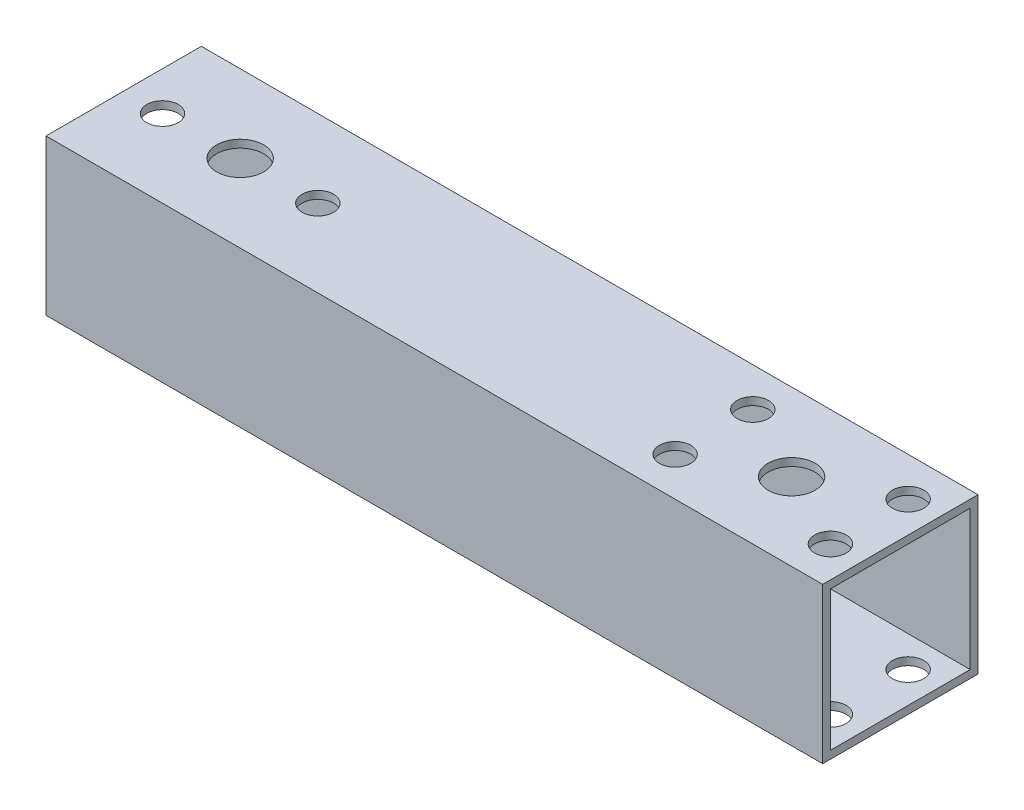
ISO-10303-21;
HEADER;
FILE_DESCRIPTION(('STEP AP214'),'2;1');
FILE_NAME('part.step','',(''),(''),'','','');
FILE_SCHEMA(('AUTOMOTIVE_DESIGN { 1 0 10303 214 1 1 1 1 }'));
ENDSEC;
DATA;
#1=APPLICATION_CONTEXT('core data for automotive mechanical design processes');
#2=APPLICATION_PROTOCOL_DEFINITION('international standard','automotive_design',2000,#1);
#3=PRODUCT_CONTEXT('',#1,'mechanical');
#4=PRODUCT('Part','Part','',(#3));
#5=PRODUCT_RELATED_PRODUCT_CATEGORY('part','',(#4));
#6=PRODUCT_DEFINITION_FORMATION('','',#4);
#7=PRODUCT_DEFINITION_CONTEXT('part definition',#1,'design');
#8=PRODUCT_DEFINITION('design','',#6,#7);
#9=PRODUCT_DEFINITION_SHAPE('','',#8);
#10=(LENGTH_UNIT() NAMED_UNIT(*) SI_UNIT(.MILLI.,.METRE.));
#11=(NAMED_UNIT(*) PLANE_ANGLE_UNIT() SI_UNIT($,.RADIAN.));
#12=(NAMED_UNIT(*) SI_UNIT($,.STERADIAN.) SOLID_ANGLE_UNIT());
#13=UNCERTAINTY_MEASURE_WITH_UNIT(LENGTH_MEASURE(1.E-05),#10,'distance_accuracy_value','');
#14=(GEOMETRIC_REPRESENTATION_CONTEXT(3) GLOBAL_UNCERTAINTY_ASSIGNED_CONTEXT((#13)) GLOBAL_UNIT_ASSIGNED_CONTEXT((#10,
#11,#12)) REPRESENTATION_CONTEXT('',''));
#15=CARTESIAN_POINT('',(0.,0.,0.));
#16=DIRECTION('',(0.,0.,1.));
#17=DIRECTION('',(1.,0.,0.));
#18=AXIS2_PLACEMENT_3D('',#15,#16,#17);
#19=CARTESIAN_POINT('',(50.,0.,0.));
#20=DIRECTION('',(1.,0.,0.));
#21=DIRECTION('',(0.,0.,-1.));
#22=AXIS2_PLACEMENT_3D('',#19,#20,#21);
#23=PLANE('',#22);
#24=DIRECTION('',(0.,0.,-1.));
#25=VECTOR('',#24,1.);
#26=CARTESIAN_POINT('',(50.,-10.,10.));
#27=LINE('',#26,#25);
#28=CARTESIAN_POINT('',(50.,-10.,10.));
#29=VERTEX_POINT('',#28);
#30=CARTESIAN_POINT('',(50.,-10.,-10.));
#31=VERTEX_POINT('',#30);
#32=EDGE_CURVE('E157',#29,#31,#27,.T.);
#33=ORIENTED_EDGE('',*,*,#32,.T.);
#34=DIRECTION('',(0.,1.,0.));
#35=VECTOR('',#34,1.);
#36=CARTESIAN_POINT('',(50.,-10.,-10.));
#37=LINE('',#36,#35);
#38=CARTESIAN_POINT('',(50.,10.,-10.));
#39=VERTEX_POINT('',#38);
#40=EDGE_CURVE('E160',#31,#39,#37,.T.);
#41=ORIENTED_EDGE('',*,*,#40,.T.);
#42=DIRECTION('',(0.,0.,1.));
#43=VECTOR('',#42,1.);
#44=CARTESIAN_POINT('',(50.,10.,10.));
#45=LINE('',#44,#43);
#46=CARTESIAN_POINT('',(50.,10.,10.));
#47=VERTEX_POINT('',#46);
#48=EDGE_CURVE('E164',#39,#47,#45,.T.);
#49=ORIENTED_EDGE('',*,*,#48,.T.);
#50=DIRECTION('',(0.,-1.,0.));
#51=VECTOR('',#50,1.);
#52=CARTESIAN_POINT('',(50.,-10.,10.));
#53=LINE('',#52,#51);
#54=EDGE_CURVE('E167',#47,#29,#53,.T.);
#55=ORIENTED_EDGE('',*,*,#54,.T.);
#56=EDGE_LOOP('',(#33,#41,#49,#55));
#57=FACE_BOUND('',#56,.T.);
#58=DIRECTION('',(0.,0.,1.));
#59=VECTOR('',#58,1.);
#60=CARTESIAN_POINT('',(50.,9.,9.));
#61=LINE('',#60,#59);
#62=CARTESIAN_POINT('',(50.,9.,-9.));
#63=VERTEX_POINT('',#62);
#64=CARTESIAN_POINT('',(50.,9.,9.));
#65=VERTEX_POINT('',#64);
#66=EDGE_CURVE('E115',#63,#65,#61,.T.);
#67=ORIENTED_EDGE('',*,*,#66,.F.);
#68=DIRECTION('',(0.,1.,0.));
#69=VECTOR('',#68,1.);
#70=CARTESIAN_POINT('',(50.,-9.,-9.));
#71=LINE('',#70,#69);
#72=CARTESIAN_POINT('',(50.,-9.,-9.));
#73=VERTEX_POINT('',#72);
#74=EDGE_CURVE('E106',#73,#63,#71,.T.);
#75=ORIENTED_EDGE('',*,*,#74,.F.);
#76=DIRECTION('',(0.,0.,-1.));
#77=VECTOR('',#76,1.);
#78=CARTESIAN_POINT('',(50.,-9.,9.));
#79=LINE('',#78,#77);
#80=CARTESIAN_POINT('',(50.,-9.,9.));
#81=VERTEX_POINT('',#80);
#82=EDGE_CURVE('E133',#81,#73,#79,.T.);
#83=ORIENTED_EDGE('',*,*,#82,.F.);
#84=DIRECTION('',(0.,-1.,0.));
#85=VECTOR('',#84,1.);
#86=CARTESIAN_POINT('',(50.,-9.,9.));
#87=LINE('',#86,#85);
#88=EDGE_CURVE('E128',#65,#81,#87,.T.);
#89=ORIENTED_EDGE('',*,*,#88,.F.);
#90=EDGE_LOOP('',(#67,#75,#83,#89));
#91=FACE_BOUND('',#90,.T.);
#92=ADVANCED_FACE('F38',(#57,#91),#23,.T.);
#93=CARTESIAN_POINT('',(-50.,0.,0.));
#94=DIRECTION('',(1.,0.,0.));
#95=DIRECTION('',(0.,0.,-1.));
#96=AXIS2_PLACEMENT_3D('',#93,#94,#95);
#97=PLANE('',#96);
#98=DIRECTION('',(0.,0.,-1.));
#99=VECTOR('',#98,1.);
#100=CARTESIAN_POINT('',(-50.,-10.,10.));
#101=LINE('',#100,#99);
#102=CARTESIAN_POINT('',(-50.,-10.,10.));
#103=VERTEX_POINT('',#102);
#104=CARTESIAN_POINT('',(-50.,-10.,-10.));
#105=VERTEX_POINT('',#104);
#106=EDGE_CURVE('E124',#103,#105,#101,.T.);
#107=ORIENTED_EDGE('',*,*,#106,.F.);
#108=DIRECTION('',(0.,-1.,0.));
#109=VECTOR('',#108,1.);
#110=CARTESIAN_POINT('',(-50.,-10.,10.));
#111=LINE('',#110,#109);
#112=CARTESIAN_POINT('',(-50.,10.,10.));
#113=VERTEX_POINT('',#112);
#114=EDGE_CURVE('E161',#113,#103,#111,.T.);
#115=ORIENTED_EDGE('',*,*,#114,.F.);
#116=DIRECTION('',(0.,0.,1.));
#117=VECTOR('',#116,1.);
#118=CARTESIAN_POINT('',(-50.,10.,10.));
#119=LINE('',#118,#117);
#120=CARTESIAN_POINT('',(-50.,10.,-10.));
#121=VERTEX_POINT('',#120);
#122=EDGE_CURVE('E177',#121,#113,#119,.T.);
#123=ORIENTED_EDGE('',*,*,#122,.F.);
#124=DIRECTION('',(0.,1.,0.));
#125=VECTOR('',#124,1.);
#126=CARTESIAN_POINT('',(-50.,-10.,-10.));
#127=LINE('',#126,#125);
#128=EDGE_CURVE('E174',#105,#121,#127,.T.);
#129=ORIENTED_EDGE('',*,*,#128,.F.);
#130=EDGE_LOOP('',(#107,#115,#123,#129));
#131=FACE_BOUND('',#130,.T.);
#132=DIRECTION('',(0.,1.,0.));
#133=VECTOR('',#132,1.);
#134=CARTESIAN_POINT('',(-50.,-9.,-9.));
#135=LINE('',#134,#133);
#136=CARTESIAN_POINT('',(-50.,-9.,-9.));
#137=VERTEX_POINT('',#136);
#138=CARTESIAN_POINT('',(-50.,9.,-9.));
#139=VERTEX_POINT('',#138);
#140=EDGE_CURVE('E64',#137,#139,#135,.T.);
#141=ORIENTED_EDGE('',*,*,#140,.T.);
#142=DIRECTION('',(0.,0.,1.));
#143=VECTOR('',#142,1.);
#144=CARTESIAN_POINT('',(-50.,9.,9.));
#145=LINE('',#144,#143);
#146=CARTESIAN_POINT('',(-50.,9.,9.));
#147=VERTEX_POINT('',#146);
#148=EDGE_CURVE('E122',#139,#147,#145,.T.);
#149=ORIENTED_EDGE('',*,*,#148,.T.);
#150=DIRECTION('',(0.,-1.,0.));
#151=VECTOR('',#150,1.);
#152=CARTESIAN_POINT('',(-50.,-9.,9.));
#153=LINE('',#152,#151);
#154=CARTESIAN_POINT('',(-50.,-9.,9.));
#155=VERTEX_POINT('',#154);
#156=EDGE_CURVE('E144',#147,#155,#153,.T.);
#157=ORIENTED_EDGE('',*,*,#156,.T.);
#158=DIRECTION('',(0.,0.,-1.));
#159=VECTOR('',#158,1.);
#160=CARTESIAN_POINT('',(-50.,-9.,9.));
#161=LINE('',#160,#159);
#162=EDGE_CURVE('E116',#155,#137,#161,.T.);
#163=ORIENTED_EDGE('',*,*,#162,.T.);
#164=EDGE_LOOP('',(#141,#149,#157,#163));
#165=FACE_BOUND('',#164,.T.);
#166=ADVANCED_FACE('F287',(#131,#165),#97,.F.);
#167=CARTESIAN_POINT('',(50.,-10.,10.));
#168=DIRECTION('',(0.,1.,0.));
#169=DIRECTION('',(0.,0.,1.));
#170=AXIS2_PLACEMENT_3D('',#167,#168,#169);
#171=PLANE('',#170);
#172=CARTESIAN_POINT('',(-45.,-10.,0.));
#173=DIRECTION('',(0.,1.,0.));
#174=DIRECTION('',(0.,0.,1.));
#175=AXIS2_PLACEMENT_3D('',#172,#173,#174);
#176=CIRCLE('',#175,2.02499999999999);
#177=CARTESIAN_POINT('',(-45.,-10.,2.02499999999999));
#178=VERTEX_POINT('',#177);
#179=EDGE_CURVE('E141',#178,#178,#176,.T.);
#180=ORIENTED_EDGE('',*,*,#179,.T.);
#181=EDGE_LOOP('',(#180));
#182=FACE_BOUND('',#181,.T.);
#183=CARTESIAN_POINT('',(-25.,-10.,0.));
#184=DIRECTION('',(0.,1.,0.));
#185=DIRECTION('',(0.,0.,1.));
#186=AXIS2_PLACEMENT_3D('',#183,#184,#185);
#187=CIRCLE('',#186,2.025);
#188=CARTESIAN_POINT('',(-25.,-10.,2.025));
#189=VERTEX_POINT('',#188);
#190=EDGE_CURVE('E238',#189,#189,#187,.T.);
#191=ORIENTED_EDGE('',*,*,#190,.T.);
#192=EDGE_LOOP('',(#191));
#193=FACE_BOUND('',#192,.T.);
#194=CARTESIAN_POINT('',(-35.,-10.,0.));
#195=DIRECTION('',(0.,1.,0.));
#196=DIRECTION('',(0.,0.,1.));
#197=AXIS2_PLACEMENT_3D('',#194,#195,#196);
#198=CIRCLE('',#197,3.02500000000001);
#199=CARTESIAN_POINT('',(-35.,-10.,3.02500000000001));
#200=VERTEX_POINT('',#199);
#201=EDGE_CURVE('E231',#200,#200,#198,.T.);
#202=ORIENTED_EDGE('',*,*,#201,.T.);
#203=EDGE_LOOP('',(#202));
#204=FACE_BOUND('',#203,.T.);
#205=CARTESIAN_POINT('',(36.,-10.,0.));
#206=DIRECTION('',(0.,1.,0.));
#207=DIRECTION('',(0.,0.,1.));
#208=AXIS2_PLACEMENT_3D('',#205,#206,#207);
#209=CIRCLE('',#208,3.025);
#210=CARTESIAN_POINT('',(36.,-10.,3.025));
#211=VERTEX_POINT('',#210);
#212=EDGE_CURVE('E226',#211,#211,#209,.T.);
#213=ORIENTED_EDGE('',*,*,#212,.T.);
#214=EDGE_LOOP('',(#213));
#215=FACE_BOUND('',#214,.T.);
#216=CARTESIAN_POINT('',(26.,-10.,5.00000000000001));
#217=DIRECTION('',(0.,1.,0.));
#218=DIRECTION('',(0.,0.,1.));
#219=AXIS2_PLACEMENT_3D('',#216,#217,#218);
#220=CIRCLE('',#219,2.025);
#221=CARTESIAN_POINT('',(26.,-10.,7.02500000000001));
#222=VERTEX_POINT('',#221);
#223=EDGE_CURVE('E221',#222,#222,#220,.T.);
#224=ORIENTED_EDGE('',*,*,#223,.T.);
#225=EDGE_LOOP('',(#224));
#226=FACE_BOUND('',#225,.T.);
#227=CARTESIAN_POINT('',(46.,-10.,5.00000000000001));
#228=DIRECTION('',(0.,1.,0.));
#229=DIRECTION('',(0.,0.,1.));
#230=AXIS2_PLACEMENT_3D('',#227,#228,#229);
#231=CIRCLE('',#230,2.02500000000001);
#232=CARTESIAN_POINT('',(46.,-10.,7.02500000000002));
#233=VERTEX_POINT('',#232);
#234=EDGE_CURVE('E215',#233,#233,#231,.T.);
#235=ORIENTED_EDGE('',*,*,#234,.T.);
#236=EDGE_LOOP('',(#235));
#237=FACE_BOUND('',#236,.T.);
#238=CARTESIAN_POINT('',(46.,-10.,-4.99999999999999));
#239=DIRECTION('',(0.,1.,0.));
#240=DIRECTION('',(0.,0.,1.));
#241=AXIS2_PLACEMENT_3D('',#238,#239,#240);
#242=CIRCLE('',#241,2.02500000000001);
#243=CARTESIAN_POINT('',(46.,-10.,-2.97499999999998));
#244=VERTEX_POINT('',#243);
#245=EDGE_CURVE('E209',#244,#244,#242,.T.);
#246=ORIENTED_EDGE('',*,*,#245,.T.);
#247=EDGE_LOOP('',(#246));
#248=FACE_BOUND('',#247,.T.);
#249=CARTESIAN_POINT('',(26.,-10.,-4.99999999999999));
#250=DIRECTION('',(0.,1.,0.));
#251=DIRECTION('',(0.,0.,1.));
#252=AXIS2_PLACEMENT_3D('',#249,#250,#251);
#253=CIRCLE('',#252,2.025);
#254=CARTESIAN_POINT('',(26.,-10.,-2.97499999999999));
#255=VERTEX_POINT('',#254);
#256=EDGE_CURVE('E203',#255,#255,#253,.T.);
#257=ORIENTED_EDGE('',*,*,#256,.T.);
#258=EDGE_LOOP('',(#257));
#259=FACE_BOUND('',#258,.T.);
#260=ORIENTED_EDGE('',*,*,#106,.T.);
#261=DIRECTION('',(-1.,0.,0.));
#262=VECTOR('',#261,1.);
#263=CARTESIAN_POINT('',(50.,-10.,-10.));
#264=LINE('',#263,#262);
#265=EDGE_CURVE('E11',#31,#105,#264,.T.);
#266=ORIENTED_EDGE('',*,*,#265,.F.);
#267=ORIENTED_EDGE('',*,*,#32,.F.);
#268=DIRECTION('',(-1.,0.,0.));
#269=VECTOR('',#268,1.);
#270=CARTESIAN_POINT('',(50.,-10.,10.));
#271=LINE('',#270,#269);
#272=EDGE_CURVE('E170',#29,#103,#271,.T.);
#273=ORIENTED_EDGE('',*,*,#272,.T.);
#274=EDGE_LOOP('',(#260,#266,#267,#273));
#275=FACE_BOUND('',#274,.T.);
#276=ADVANCED_FACE('F40',(#182,#193,#204,#215,#226,#237,#248,#259,#275),#171,.F.);
#277=CARTESIAN_POINT('',(50.,-10.,-10.));
#278=DIRECTION('',(0.,0.,1.));
#279=DIRECTION('',(1.,0.,0.));
#280=AXIS2_PLACEMENT_3D('',#277,#278,#279);
#281=PLANE('',#280);
#282=ORIENTED_EDGE('',*,*,#128,.T.);
#283=DIRECTION('',(-1.,0.,0.));
#284=VECTOR('',#283,1.);
#285=CARTESIAN_POINT('',(50.,10.,-10.));
#286=LINE('',#285,#284);
#287=EDGE_CURVE('E48',#39,#121,#286,.T.);
#288=ORIENTED_EDGE('',*,*,#287,.F.);
#289=ORIENTED_EDGE('',*,*,#40,.F.);
#290=ORIENTED_EDGE('',*,*,#265,.T.);
#291=EDGE_LOOP('',(#282,#288,#289,#290));
#292=FACE_BOUND('',#291,.T.);
#293=ADVANCED_FACE('F304',(#292),#281,.F.);
#294=CARTESIAN_POINT('',(50.,10.,10.));
#295=DIRECTION('',(0.,-1.,0.));
#296=DIRECTION('',(0.,0.,-1.));
#297=AXIS2_PLACEMENT_3D('',#294,#295,#296);
#298=PLANE('',#297);
#299=CARTESIAN_POINT('',(-45.,10.,0.));
#300=DIRECTION('',(0.,1.,0.));
#301=DIRECTION('',(0.,0.,1.));
#302=AXIS2_PLACEMENT_3D('',#299,#300,#301);
#303=CIRCLE('',#302,2.02499999999999);
#304=CARTESIAN_POINT('',(-45.,10.,2.02499999999999));
#305=VERTEX_POINT('',#304);
#306=EDGE_CURVE('E424',#305,#305,#303,.T.);
#307=ORIENTED_EDGE('',*,*,#306,.F.);
#308=EDGE_LOOP('',(#307));
#309=FACE_BOUND('',#308,.T.);
#310=CARTESIAN_POINT('',(-25.,10.,0.));
#311=DIRECTION('',(0.,1.,0.));
#312=DIRECTION('',(0.,0.,1.));
#313=AXIS2_PLACEMENT_3D('',#310,#311,#312);
#314=CIRCLE('',#313,2.025);
#315=CARTESIAN_POINT('',(-25.,10.,2.025));
#316=VERTEX_POINT('',#315);
#317=EDGE_CURVE('E431',#316,#316,#314,.T.);
#318=ORIENTED_EDGE('',*,*,#317,.F.);
#319=EDGE_LOOP('',(#318));
#320=FACE_BOUND('',#319,.T.);
#321=CARTESIAN_POINT('',(-35.,10.,0.));
#322=DIRECTION('',(0.,1.,0.));
#323=DIRECTION('',(0.,0.,1.));
#324=AXIS2_PLACEMENT_3D('',#321,#322,#323);
#325=CIRCLE('',#324,3.02500000000001);
#326=CARTESIAN_POINT('',(-35.,10.,3.02500000000001));
#327=VERTEX_POINT('',#326);
#328=EDGE_CURVE('E435',#327,#327,#325,.T.);
#329=ORIENTED_EDGE('',*,*,#328,.F.);
#330=EDGE_LOOP('',(#329));
#331=FACE_BOUND('',#330,.T.);
#332=CARTESIAN_POINT('',(36.,10.,0.));
#333=DIRECTION('',(0.,1.,0.));
#334=DIRECTION('',(0.,0.,1.));
#335=AXIS2_PLACEMENT_3D('',#332,#333,#334);
#336=CIRCLE('',#335,3.025);
#337=CARTESIAN_POINT('',(36.,10.,3.025));
#338=VERTEX_POINT('',#337);
#339=EDGE_CURVE('E421',#338,#338,#336,.T.);
#340=ORIENTED_EDGE('',*,*,#339,.F.);
#341=EDGE_LOOP('',(#340));
#342=FACE_BOUND('',#341,.T.);
#343=CARTESIAN_POINT('',(26.,10.,5.00000000000001));
#344=DIRECTION('',(0.,1.,0.));
#345=DIRECTION('',(0.,0.,1.));
#346=AXIS2_PLACEMENT_3D('',#343,#344,#345);
#347=CIRCLE('',#346,2.025);
#348=CARTESIAN_POINT('',(26.,10.,7.02500000000001));
#349=VERTEX_POINT('',#348);
#350=EDGE_CURVE('E423',#349,#349,#347,.T.);
#351=ORIENTED_EDGE('',*,*,#350,.F.);
#352=EDGE_LOOP('',(#351));
#353=FACE_BOUND('',#352,.T.);
#354=CARTESIAN_POINT('',(46.,10.,5.00000000000001));
#355=DIRECTION('',(0.,1.,0.));
#356=DIRECTION('',(0.,0.,1.));
#357=AXIS2_PLACEMENT_3D('',#354,#355,#356);
#358=CIRCLE('',#357,2.02500000000001);
#359=CARTESIAN_POINT('',(46.,10.,7.02500000000002));
#360=VERTEX_POINT('',#359);
#361=EDGE_CURVE('E427',#360,#360,#358,.T.);
#362=ORIENTED_EDGE('',*,*,#361,.F.);
#363=EDGE_LOOP('',(#362));
#364=FACE_BOUND('',#363,.T.);
#365=CARTESIAN_POINT('',(46.,10.,-4.99999999999999));
#366=DIRECTION('',(0.,1.,0.));
#367=DIRECTION('',(0.,0.,1.));
#368=AXIS2_PLACEMENT_3D('',#365,#366,#367);
#369=CIRCLE('',#368,2.02500000000001);
#370=CARTESIAN_POINT('',(46.,10.,-2.97499999999998));
#371=VERTEX_POINT('',#370);
#372=EDGE_CURVE('E454',#371,#371,#369,.T.);
#373=ORIENTED_EDGE('',*,*,#372,.F.);
#374=EDGE_LOOP('',(#373));
#375=FACE_BOUND('',#374,.T.);
#376=CARTESIAN_POINT('',(26.,10.,-4.99999999999999));
#377=DIRECTION('',(0.,1.,0.));
#378=DIRECTION('',(0.,0.,1.));
#379=AXIS2_PLACEMENT_3D('',#376,#377,#378);
#380=CIRCLE('',#379,2.025);
#381=CARTESIAN_POINT('',(26.,10.,-2.97499999999999));
#382=VERTEX_POINT('',#381);
#383=EDGE_CURVE('E197',#382,#382,#380,.T.);
#384=ORIENTED_EDGE('',*,*,#383,.F.);
#385=EDGE_LOOP('',(#384));
#386=FACE_BOUND('',#385,.T.);
#387=ORIENTED_EDGE('',*,*,#122,.T.);
#388=DIRECTION('',(-1.,0.,0.));
#389=VECTOR('',#388,1.);
#390=CARTESIAN_POINT('',(50.,10.,10.));
#391=LINE('',#390,#389);
#392=EDGE_CURVE('E185',#47,#113,#391,.T.);
#393=ORIENTED_EDGE('',*,*,#392,.F.);
#394=ORIENTED_EDGE('',*,*,#48,.F.);
#395=ORIENTED_EDGE('',*,*,#287,.T.);
#396=EDGE_LOOP('',(#387,#393,#394,#395));
#397=FACE_BOUND('',#396,.T.);
#398=ADVANCED_FACE('F301',(#309,#320,#331,#342,#353,#364,#375,#386,#397),#298,.F.);
#399=CARTESIAN_POINT('',(50.,-10.,10.));
#400=DIRECTION('',(0.,0.,-1.));
#401=DIRECTION('',(-1.,0.,0.));
#402=AXIS2_PLACEMENT_3D('',#399,#400,#401);
#403=PLANE('',#402);
#404=ORIENTED_EDGE('',*,*,#114,.T.);
#405=ORIENTED_EDGE('',*,*,#272,.F.);
#406=ORIENTED_EDGE('',*,*,#54,.F.);
#407=ORIENTED_EDGE('',*,*,#392,.T.);
#408=EDGE_LOOP('',(#404,#405,#406,#407));
#409=FACE_BOUND('',#408,.T.);
#410=ADVANCED_FACE('F298',(#409),#403,.F.);
#411=CARTESIAN_POINT('',(50.,-9.,-9.));
#412=DIRECTION('',(0.,0.,1.));
#413=DIRECTION('',(1.,0.,0.));
#414=AXIS2_PLACEMENT_3D('',#411,#412,#413);
#415=PLANE('',#414);
#416=ORIENTED_EDGE('',*,*,#140,.F.);
#417=DIRECTION('',(-1.,0.,0.));
#418=VECTOR('',#417,1.);
#419=CARTESIAN_POINT('',(50.,-9.,-9.));
#420=LINE('',#419,#418);
#421=EDGE_CURVE('E110',#73,#137,#420,.T.);
#422=ORIENTED_EDGE('',*,*,#421,.F.);
#423=ORIENTED_EDGE('',*,*,#74,.T.);
#424=DIRECTION('',(-1.,0.,0.));
#425=VECTOR('',#424,1.);
#426=CARTESIAN_POINT('',(50.,9.,-9.));
#427=LINE('',#426,#425);
#428=EDGE_CURVE('E109',#63,#139,#427,.T.);
#429=ORIENTED_EDGE('',*,*,#428,.T.);
#430=EDGE_LOOP('',(#416,#422,#423,#429));
#431=FACE_BOUND('',#430,.T.);
#432=ADVANCED_FACE('F108',(#431),#415,.T.);
#433=CARTESIAN_POINT('',(50.,9.,9.));
#434=DIRECTION('',(0.,-1.,0.));
#435=DIRECTION('',(0.,0.,-1.));
#436=AXIS2_PLACEMENT_3D('',#433,#434,#435);
#437=PLANE('',#436);
#438=CARTESIAN_POINT('',(-45.,9.,0.));
#439=DIRECTION('',(0.,-1.,0.));
#440=DIRECTION('',(0.,0.,-1.));
#441=AXIS2_PLACEMENT_3D('',#438,#439,#440);
#442=CIRCLE('',#441,2.02499999999999);
#443=CARTESIAN_POINT('',(-45.,9.,-2.02499999999999));
#444=VERTEX_POINT('',#443);
#445=EDGE_CURVE('E253',#444,#444,#442,.T.);
#446=ORIENTED_EDGE('',*,*,#445,.F.);
#447=EDGE_LOOP('',(#446));
#448=FACE_BOUND('',#447,.T.);
#449=CARTESIAN_POINT('',(-25.,9.,0.));
#450=DIRECTION('',(0.,-1.,0.));
#451=DIRECTION('',(0.,0.,-1.));
#452=AXIS2_PLACEMENT_3D('',#449,#450,#451);
#453=CIRCLE('',#452,2.025);
#454=CARTESIAN_POINT('',(-25.,9.,-2.025));
#455=VERTEX_POINT('',#454);
#456=EDGE_CURVE('E230',#455,#455,#453,.T.);
#457=ORIENTED_EDGE('',*,*,#456,.F.);
#458=EDGE_LOOP('',(#457));
#459=FACE_BOUND('',#458,.T.);
#460=CARTESIAN_POINT('',(-35.,9.,0.));
#461=DIRECTION('',(0.,-1.,0.));
#462=DIRECTION('',(0.,0.,-1.));
#463=AXIS2_PLACEMENT_3D('',#460,#461,#462);
#464=CIRCLE('',#463,3.02500000000001);
#465=CARTESIAN_POINT('',(-35.,9.,-3.02500000000001));
#466=VERTEX_POINT('',#465);
#467=EDGE_CURVE('E225',#466,#466,#464,.T.);
#468=ORIENTED_EDGE('',*,*,#467,.F.);
#469=EDGE_LOOP('',(#468));
#470=FACE_BOUND('',#469,.T.);
#471=CARTESIAN_POINT('',(36.,9.,0.));
#472=DIRECTION('',(0.,-1.,0.));
#473=DIRECTION('',(0.,0.,-1.));
#474=AXIS2_PLACEMENT_3D('',#471,#472,#473);
#475=CIRCLE('',#474,3.025);
#476=CARTESIAN_POINT('',(36.,9.,-3.025));
#477=VERTEX_POINT('',#476);
#478=EDGE_CURVE('E220',#477,#477,#475,.T.);
#479=ORIENTED_EDGE('',*,*,#478,.F.);
#480=EDGE_LOOP('',(#479));
#481=FACE_BOUND('',#480,.T.);
#482=CARTESIAN_POINT('',(26.,9.,5.00000000000001));
#483=DIRECTION('',(0.,-1.,0.));
#484=DIRECTION('',(0.,0.,-1.));
#485=AXIS2_PLACEMENT_3D('',#482,#483,#484);
#486=CIRCLE('',#485,2.025);
#487=CARTESIAN_POINT('',(26.,9.,2.97500000000001));
#488=VERTEX_POINT('',#487);
#489=EDGE_CURVE('E214',#488,#488,#486,.T.);
#490=ORIENTED_EDGE('',*,*,#489,.F.);
#491=EDGE_LOOP('',(#490));
#492=FACE_BOUND('',#491,.T.);
#493=CARTESIAN_POINT('',(46.,9.,5.00000000000001));
#494=DIRECTION('',(0.,-1.,0.));
#495=DIRECTION('',(0.,0.,-1.));
#496=AXIS2_PLACEMENT_3D('',#493,#494,#495);
#497=CIRCLE('',#496,2.02500000000001);
#498=CARTESIAN_POINT('',(46.,9.,2.975));
#499=VERTEX_POINT('',#498);
#500=EDGE_CURVE('E208',#499,#499,#497,.T.);
#501=ORIENTED_EDGE('',*,*,#500,.F.);
#502=EDGE_LOOP('',(#501));
#503=FACE_BOUND('',#502,.T.);
#504=CARTESIAN_POINT('',(46.,9.,-4.99999999999999));
#505=DIRECTION('',(0.,-1.,0.));
#506=DIRECTION('',(0.,0.,-1.));
#507=AXIS2_PLACEMENT_3D('',#504,#505,#506);
#508=CIRCLE('',#507,2.02500000000001);
#509=CARTESIAN_POINT('',(46.,9.,-7.025));
#510=VERTEX_POINT('',#509);
#511=EDGE_CURVE('E202',#510,#510,#508,.T.);
#512=ORIENTED_EDGE('',*,*,#511,.F.);
#513=EDGE_LOOP('',(#512));
#514=FACE_BOUND('',#513,.T.);
#515=CARTESIAN_POINT('',(26.,9.,-4.99999999999999));
#516=DIRECTION('',(0.,-1.,0.));
#517=DIRECTION('',(0.,0.,-1.));
#518=AXIS2_PLACEMENT_3D('',#515,#516,#517);
#519=CIRCLE('',#518,2.025);
#520=CARTESIAN_POINT('',(26.,9.,-7.02499999999999));
#521=VERTEX_POINT('',#520);
#522=EDGE_CURVE('E196',#521,#521,#519,.T.);
#523=ORIENTED_EDGE('',*,*,#522,.F.);
#524=EDGE_LOOP('',(#523));
#525=FACE_BOUND('',#524,.T.);
#526=ORIENTED_EDGE('',*,*,#148,.F.);
#527=ORIENTED_EDGE('',*,*,#428,.F.);
#528=ORIENTED_EDGE('',*,*,#66,.T.);
#529=DIRECTION('',(-1.,0.,0.));
#530=VECTOR('',#529,1.);
#531=CARTESIAN_POINT('',(50.,9.,9.));
#532=LINE('',#531,#530);
#533=EDGE_CURVE('E125',#65,#147,#532,.T.);
#534=ORIENTED_EDGE('',*,*,#533,.T.);
#535=EDGE_LOOP('',(#526,#527,#528,#534));
#536=FACE_BOUND('',#535,.T.);
#537=ADVANCED_FACE('F119',(#448,#459,#470,#481,#492,#503,#514,#525,#536),#437,.T.);
#538=CARTESIAN_POINT('',(50.,-9.,9.));
#539=DIRECTION('',(0.,0.,-1.));
#540=DIRECTION('',(-1.,0.,0.));
#541=AXIS2_PLACEMENT_3D('',#538,#539,#540);
#542=PLANE('',#541);
#543=ORIENTED_EDGE('',*,*,#156,.F.);
#544=ORIENTED_EDGE('',*,*,#533,.F.);
#545=ORIENTED_EDGE('',*,*,#88,.T.);
#546=DIRECTION('',(-1.,0.,0.));
#547=VECTOR('',#546,1.);
#548=CARTESIAN_POINT('',(50.,-9.,9.));
#549=LINE('',#548,#547);
#550=EDGE_CURVE('E56',#81,#155,#549,.T.);
#551=ORIENTED_EDGE('',*,*,#550,.T.);
#552=EDGE_LOOP('',(#543,#544,#545,#551));
#553=FACE_BOUND('',#552,.T.);
#554=ADVANCED_FACE('F327',(#553),#542,.T.);
#555=CARTESIAN_POINT('',(50.,-9.,9.));
#556=DIRECTION('',(0.,1.,0.));
#557=DIRECTION('',(0.,0.,1.));
#558=AXIS2_PLACEMENT_3D('',#555,#556,#557);
#559=PLANE('',#558);
#560=CARTESIAN_POINT('',(-45.,-9.,0.));
#561=DIRECTION('',(0.,1.,0.));
#562=DIRECTION('',(0.,0.,1.));
#563=AXIS2_PLACEMENT_3D('',#560,#561,#562);
#564=CIRCLE('',#563,2.02499999999999);
#565=CARTESIAN_POINT('',(-45.,-9.,2.02499999999999));
#566=VERTEX_POINT('',#565);
#567=EDGE_CURVE('E42',#566,#566,#564,.T.);
#568=ORIENTED_EDGE('',*,*,#567,.F.);
#569=EDGE_LOOP('',(#568));
#570=FACE_BOUND('',#569,.T.);
#571=CARTESIAN_POINT('',(-25.,-9.,0.));
#572=DIRECTION('',(0.,1.,0.));
#573=DIRECTION('',(0.,0.,1.));
#574=AXIS2_PLACEMENT_3D('',#571,#572,#573);
#575=CIRCLE('',#574,2.025);
#576=CARTESIAN_POINT('',(-25.,-9.,2.025));
#577=VERTEX_POINT('',#576);
#578=EDGE_CURVE('E227',#577,#577,#575,.T.);
#579=ORIENTED_EDGE('',*,*,#578,.F.);
#580=EDGE_LOOP('',(#579));
#581=FACE_BOUND('',#580,.T.);
#582=CARTESIAN_POINT('',(-35.,-9.,0.));
#583=DIRECTION('',(0.,1.,0.));
#584=DIRECTION('',(0.,0.,1.));
#585=AXIS2_PLACEMENT_3D('',#582,#583,#584);
#586=CIRCLE('',#585,3.02500000000001);
#587=CARTESIAN_POINT('',(-35.,-9.,3.02500000000001));
#588=VERTEX_POINT('',#587);
#589=EDGE_CURVE('E222',#588,#588,#586,.T.);
#590=ORIENTED_EDGE('',*,*,#589,.F.);
#591=EDGE_LOOP('',(#590));
#592=FACE_BOUND('',#591,.T.);
#593=CARTESIAN_POINT('',(36.,-9.,0.));
#594=DIRECTION('',(0.,1.,0.));
#595=DIRECTION('',(0.,0.,1.));
#596=AXIS2_PLACEMENT_3D('',#593,#594,#595);
#597=CIRCLE('',#596,3.025);
#598=CARTESIAN_POINT('',(36.,-9.,3.025));
#599=VERTEX_POINT('',#598);
#600=EDGE_CURVE('E216',#599,#599,#597,.T.);
#601=ORIENTED_EDGE('',*,*,#600,.F.);
#602=EDGE_LOOP('',(#601));
#603=FACE_BOUND('',#602,.T.);
#604=CARTESIAN_POINT('',(26.,-9.,5.00000000000001));
#605=DIRECTION('',(0.,1.,0.));
#606=DIRECTION('',(0.,0.,1.));
#607=AXIS2_PLACEMENT_3D('',#604,#605,#606);
#608=CIRCLE('',#607,2.025);
#609=CARTESIAN_POINT('',(26.,-9.,7.02500000000001));
#610=VERTEX_POINT('',#609);
#611=EDGE_CURVE('E210',#610,#610,#608,.T.);
#612=ORIENTED_EDGE('',*,*,#611,.F.);
#613=EDGE_LOOP('',(#612));
#614=FACE_BOUND('',#613,.T.);
#615=CARTESIAN_POINT('',(46.,-9.,5.00000000000001));
#616=DIRECTION('',(0.,1.,0.));
#617=DIRECTION('',(0.,0.,1.));
#618=AXIS2_PLACEMENT_3D('',#615,#616,#617);
#619=CIRCLE('',#618,2.02500000000001);
#620=CARTESIAN_POINT('',(46.,-9.,7.02500000000002));
#621=VERTEX_POINT('',#620);
#622=EDGE_CURVE('E204',#621,#621,#619,.T.);
#623=ORIENTED_EDGE('',*,*,#622,.F.);
#624=EDGE_LOOP('',(#623));
#625=FACE_BOUND('',#624,.T.);
#626=CARTESIAN_POINT('',(46.,-9.,-4.99999999999999));
#627=DIRECTION('',(0.,1.,0.));
#628=DIRECTION('',(0.,0.,1.));
#629=AXIS2_PLACEMENT_3D('',#626,#627,#628);
#630=CIRCLE('',#629,2.02500000000001);
#631=CARTESIAN_POINT('',(46.,-9.,-2.97499999999998));
#632=VERTEX_POINT('',#631);
#633=EDGE_CURVE('E198',#632,#632,#630,.T.);
#634=ORIENTED_EDGE('',*,*,#633,.F.);
#635=EDGE_LOOP('',(#634));
#636=FACE_BOUND('',#635,.T.);
#637=CARTESIAN_POINT('',(26.,-9.,-4.99999999999999));
#638=DIRECTION('',(0.,1.,0.));
#639=DIRECTION('',(0.,0.,1.));
#640=AXIS2_PLACEMENT_3D('',#637,#638,#639);
#641=CIRCLE('',#640,2.025);
#642=CARTESIAN_POINT('',(26.,-9.,-2.97499999999999));
#643=VERTEX_POINT('',#642);
#644=EDGE_CURVE('E192',#643,#643,#641,.T.);
#645=ORIENTED_EDGE('',*,*,#644,.F.);
#646=EDGE_LOOP('',(#645));
#647=FACE_BOUND('',#646,.T.);
#648=ORIENTED_EDGE('',*,*,#162,.F.);
#649=ORIENTED_EDGE('',*,*,#550,.F.);
#650=ORIENTED_EDGE('',*,*,#82,.T.);
#651=ORIENTED_EDGE('',*,*,#421,.T.);
#652=EDGE_LOOP('',(#648,#649,#650,#651));
#653=FACE_BOUND('',#652,.T.);
#654=ADVANCED_FACE('F325',(#570,#581,#592,#603,#614,#625,#636,#647,#653),#559,.T.);
#655=CARTESIAN_POINT('',(26.,-30.,-4.99999999999999));
#656=DIRECTION('',(0.,1.,0.));
#657=DIRECTION('',(0.,0.,1.));
#658=AXIS2_PLACEMENT_3D('',#655,#656,#657);
#659=CYLINDRICAL_SURFACE('',#658,2.025);
#660=ORIENTED_EDGE('',*,*,#644,.T.);
#661=EDGE_LOOP('',(#660));
#662=FACE_BOUND('',#661,.T.);
#663=ORIENTED_EDGE('',*,*,#256,.F.);
#664=EDGE_LOOP('',(#663));
#665=FACE_BOUND('',#664,.T.);
#666=ADVANCED_FACE('F278',(#662,#665),#659,.F.);
#667=CARTESIAN_POINT('',(46.,-30.,-4.99999999999999));
#668=DIRECTION('',(0.,1.,0.));
#669=DIRECTION('',(0.,0.,1.));
#670=AXIS2_PLACEMENT_3D('',#667,#668,#669);
#671=CYLINDRICAL_SURFACE('',#670,2.02500000000001);
#672=ORIENTED_EDGE('',*,*,#633,.T.);
#673=EDGE_LOOP('',(#672));
#674=FACE_BOUND('',#673,.T.);
#675=ORIENTED_EDGE('',*,*,#245,.F.);
#676=EDGE_LOOP('',(#675));
#677=FACE_BOUND('',#676,.T.);
#678=ADVANCED_FACE('F334',(#674,#677),#671,.F.);
#679=CARTESIAN_POINT('',(46.,-30.,5.00000000000001));
#680=DIRECTION('',(0.,1.,0.));
#681=DIRECTION('',(0.,0.,1.));
#682=AXIS2_PLACEMENT_3D('',#679,#680,#681);
#683=CYLINDRICAL_SURFACE('',#682,2.02500000000001);
#684=ORIENTED_EDGE('',*,*,#622,.T.);
#685=EDGE_LOOP('',(#684));
#686=FACE_BOUND('',#685,.T.);
#687=ORIENTED_EDGE('',*,*,#234,.F.);
#688=EDGE_LOOP('',(#687));
#689=FACE_BOUND('',#688,.T.);
#690=ADVANCED_FACE('F405',(#686,#689),#683,.F.);
#691=CARTESIAN_POINT('',(26.,-30.,5.00000000000001));
#692=DIRECTION('',(0.,1.,0.));
#693=DIRECTION('',(0.,0.,1.));
#694=AXIS2_PLACEMENT_3D('',#691,#692,#693);
#695=CYLINDRICAL_SURFACE('',#694,2.025);
#696=ORIENTED_EDGE('',*,*,#611,.T.);
#697=EDGE_LOOP('',(#696));
#698=FACE_BOUND('',#697,.T.);
#699=ORIENTED_EDGE('',*,*,#223,.F.);
#700=EDGE_LOOP('',(#699));
#701=FACE_BOUND('',#700,.T.);
#702=ADVANCED_FACE('F395',(#698,#701),#695,.F.);
#703=CARTESIAN_POINT('',(36.,-30.,0.));
#704=DIRECTION('',(0.,1.,0.));
#705=DIRECTION('',(0.,0.,1.));
#706=AXIS2_PLACEMENT_3D('',#703,#704,#705);
#707=CYLINDRICAL_SURFACE('',#706,3.025);
#708=ORIENTED_EDGE('',*,*,#600,.T.);
#709=EDGE_LOOP('',(#708));
#710=FACE_BOUND('',#709,.T.);
#711=ORIENTED_EDGE('',*,*,#212,.F.);
#712=EDGE_LOOP('',(#711));
#713=FACE_BOUND('',#712,.T.);
#714=ADVANCED_FACE('F393',(#710,#713),#707,.F.);
#715=CARTESIAN_POINT('',(-35.,-30.,0.));
#716=DIRECTION('',(0.,1.,0.));
#717=DIRECTION('',(0.,0.,1.));
#718=AXIS2_PLACEMENT_3D('',#715,#716,#717);
#719=CYLINDRICAL_SURFACE('',#718,3.02500000000001);
#720=ORIENTED_EDGE('',*,*,#589,.T.);
#721=EDGE_LOOP('',(#720));
#722=FACE_BOUND('',#721,.T.);
#723=ORIENTED_EDGE('',*,*,#201,.F.);
#724=EDGE_LOOP('',(#723));
#725=FACE_BOUND('',#724,.T.);
#726=ADVANCED_FACE('F279',(#722,#725),#719,.F.);
#727=CARTESIAN_POINT('',(-25.,-30.,0.));
#728=DIRECTION('',(0.,1.,0.));
#729=DIRECTION('',(0.,0.,1.));
#730=AXIS2_PLACEMENT_3D('',#727,#728,#729);
#731=CYLINDRICAL_SURFACE('',#730,2.025);
#732=ORIENTED_EDGE('',*,*,#578,.T.);
#733=EDGE_LOOP('',(#732));
#734=FACE_BOUND('',#733,.T.);
#735=ORIENTED_EDGE('',*,*,#190,.F.);
#736=EDGE_LOOP('',(#735));
#737=FACE_BOUND('',#736,.T.);
#738=ADVANCED_FACE('F267',(#734,#737),#731,.F.);
#739=CARTESIAN_POINT('',(-45.,-30.,0.));
#740=DIRECTION('',(0.,1.,0.));
#741=DIRECTION('',(0.,0.,1.));
#742=AXIS2_PLACEMENT_3D('',#739,#740,#741);
#743=CYLINDRICAL_SURFACE('',#742,2.02499999999999);
#744=ORIENTED_EDGE('',*,*,#567,.T.);
#745=EDGE_LOOP('',(#744));
#746=FACE_BOUND('',#745,.T.);
#747=ORIENTED_EDGE('',*,*,#179,.F.);
#748=EDGE_LOOP('',(#747));
#749=FACE_BOUND('',#748,.T.);
#750=ADVANCED_FACE('F264',(#746,#749),#743,.F.);
#751=ORIENTED_EDGE('',*,*,#522,.T.);
#752=EDGE_LOOP('',(#751));
#753=FACE_BOUND('',#752,.T.);
#754=ORIENTED_EDGE('',*,*,#383,.T.);
#755=EDGE_LOOP('',(#754));
#756=FACE_BOUND('',#755,.T.);
#757=ADVANCED_FACE('F266',(#753,#756),#659,.F.);
#758=ORIENTED_EDGE('',*,*,#511,.T.);
#759=EDGE_LOOP('',(#758));
#760=FACE_BOUND('',#759,.T.);
#761=ORIENTED_EDGE('',*,*,#372,.T.);
#762=EDGE_LOOP('',(#761));
#763=FACE_BOUND('',#762,.T.);
#764=ADVANCED_FACE('F275',(#760,#763),#671,.F.);
#765=ORIENTED_EDGE('',*,*,#500,.T.);
#766=EDGE_LOOP('',(#765));
#767=FACE_BOUND('',#766,.T.);
#768=ORIENTED_EDGE('',*,*,#361,.T.);
#769=EDGE_LOOP('',(#768));
#770=FACE_BOUND('',#769,.T.);
#771=ADVANCED_FACE('F416',(#767,#770),#683,.F.);
#772=ORIENTED_EDGE('',*,*,#489,.T.);
#773=EDGE_LOOP('',(#772));
#774=FACE_BOUND('',#773,.T.);
#775=ORIENTED_EDGE('',*,*,#350,.T.);
#776=EDGE_LOOP('',(#775));
#777=FACE_BOUND('',#776,.T.);
#778=ADVANCED_FACE('F408',(#774,#777),#695,.F.);
#779=ORIENTED_EDGE('',*,*,#478,.T.);
#780=EDGE_LOOP('',(#779));
#781=FACE_BOUND('',#780,.T.);
#782=ORIENTED_EDGE('',*,*,#339,.T.);
#783=EDGE_LOOP('',(#782));
#784=FACE_BOUND('',#783,.T.);
#785=ADVANCED_FACE('F398',(#781,#784),#707,.F.);
#786=ORIENTED_EDGE('',*,*,#467,.T.);
#787=EDGE_LOOP('',(#786));
#788=FACE_BOUND('',#787,.T.);
#789=ORIENTED_EDGE('',*,*,#328,.T.);
#790=EDGE_LOOP('',(#789));
#791=FACE_BOUND('',#790,.T.);
#792=ADVANCED_FACE('F404',(#788,#791),#719,.F.);
#793=ORIENTED_EDGE('',*,*,#456,.T.);
#794=EDGE_LOOP('',(#793));
#795=FACE_BOUND('',#794,.T.);
#796=ORIENTED_EDGE('',*,*,#317,.T.);
#797=EDGE_LOOP('',(#796));
#798=FACE_BOUND('',#797,.T.);
#799=ADVANCED_FACE('F281',(#795,#798),#731,.F.);
#800=ORIENTED_EDGE('',*,*,#445,.T.);
#801=EDGE_LOOP('',(#800));
#802=FACE_BOUND('',#801,.T.);
#803=ORIENTED_EDGE('',*,*,#306,.T.);
#804=EDGE_LOOP('',(#803));
#805=FACE_BOUND('',#804,.T.);
#806=ADVANCED_FACE('F270',(#802,#805),#743,.F.);
#807=CLOSED_SHELL('',(#92,#166,#276,#293,#398,#410,#432,#537,#554,#654,#666,#678,#690,#702,#714,
#726,#738,#750,#757,#764,#771,#778,#785,#792,#799,#806));
#808=MANIFOLD_SOLID_BREP('B2',#807);
#809=ADVANCED_BREP_SHAPE_REPRESENTATION('',(#18,#808),#14);
#810=SHAPE_DEFINITION_REPRESENTATION(#9,#809);
ENDSEC;
END-ISO-10303-21;
